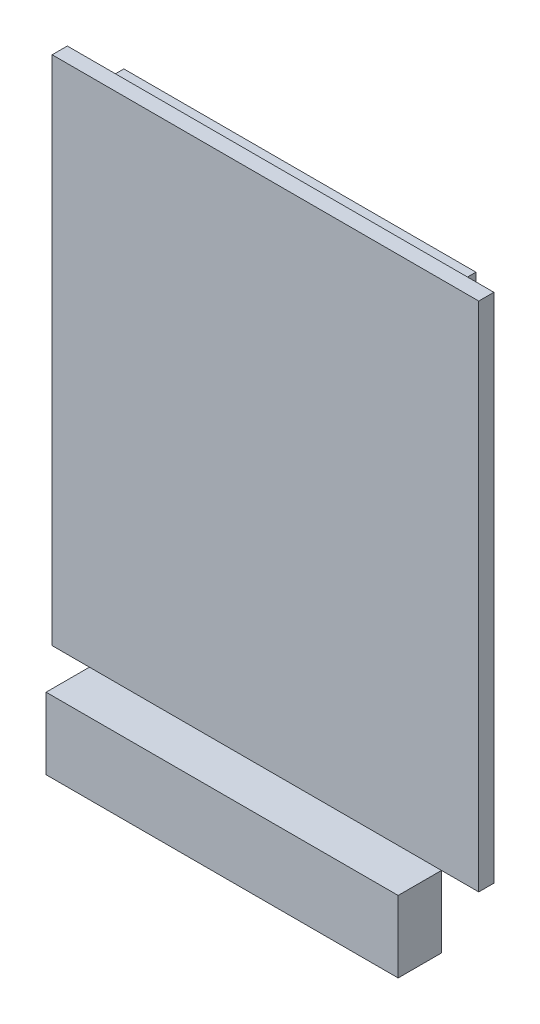
ISO-10303-21;
HEADER;
FILE_DESCRIPTION(('STEP AP214'),'2;1');
FILE_NAME('part.step','',(''),(''),'','','');
FILE_SCHEMA(('AUTOMOTIVE_DESIGN { 1 0 10303 214 1 1 1 1 }'));
ENDSEC;
DATA;
#1=APPLICATION_CONTEXT('core data for automotive mechanical design processes');
#2=APPLICATION_PROTOCOL_DEFINITION('international standard','automotive_design',2000,#1);
#3=PRODUCT_CONTEXT('',#1,'mechanical');
#4=PRODUCT('Part','Part','',(#3));
#5=PRODUCT_RELATED_PRODUCT_CATEGORY('part','',(#4));
#6=PRODUCT_DEFINITION_FORMATION('','',#4);
#7=PRODUCT_DEFINITION_CONTEXT('part definition',#1,'design');
#8=PRODUCT_DEFINITION('design','',#6,#7);
#9=PRODUCT_DEFINITION_SHAPE('','',#8);
#10=(LENGTH_UNIT() NAMED_UNIT(*) SI_UNIT(.MILLI.,.METRE.));
#11=(NAMED_UNIT(*) PLANE_ANGLE_UNIT() SI_UNIT($,.RADIAN.));
#12=(NAMED_UNIT(*) SI_UNIT($,.STERADIAN.) SOLID_ANGLE_UNIT());
#13=UNCERTAINTY_MEASURE_WITH_UNIT(LENGTH_MEASURE(1.E-05),#10,'distance_accuracy_value','');
#14=(GEOMETRIC_REPRESENTATION_CONTEXT(3) GLOBAL_UNCERTAINTY_ASSIGNED_CONTEXT((#13)) GLOBAL_UNIT_ASSIGNED_CONTEXT((#10,
#11,#12)) REPRESENTATION_CONTEXT('',''));
#15=CARTESIAN_POINT('',(0.,0.,0.));
#16=DIRECTION('',(0.,0.,1.));
#17=DIRECTION('',(1.,0.,0.));
#18=AXIS2_PLACEMENT_3D('',#15,#16,#17);
#19=CARTESIAN_POINT('',(4.36880000000001,0.,6.858));
#20=DIRECTION('',(1.,0.,0.));
#21=DIRECTION('',(0.,1.,0.));
#22=AXIS2_PLACEMENT_3D('',#19,#20,#21);
#23=PLANE('',#22);
#24=DIRECTION('',(0.,-1.,0.));
#25=VECTOR('',#24,1.);
#26=CARTESIAN_POINT('',(4.36880000000001,0.,1.778));
#27=LINE('',#26,#25);
#28=CARTESIAN_POINT('',(4.36880000000001,0.,1.778));
#29=VERTEX_POINT('',#28);
#30=CARTESIAN_POINT('',(4.3688,-8.38199999999999,1.778));
#31=VERTEX_POINT('',#30);
#32=EDGE_CURVE('E106',#29,#31,#27,.T.);
#33=ORIENTED_EDGE('',*,*,#32,.T.);
#34=DIRECTION('',(0.,0.,-1.));
#35=VECTOR('',#34,1.);
#36=CARTESIAN_POINT('',(4.3688,-8.38199999999999,6.858));
#37=LINE('',#36,#35);
#38=CARTESIAN_POINT('',(4.3688,-8.38199999999999,6.858));
#39=VERTEX_POINT('',#38);
#40=EDGE_CURVE('E12',#39,#31,#37,.T.);
#41=ORIENTED_EDGE('',*,*,#40,.F.);
#42=DIRECTION('',(0.,-1.,0.));
#43=VECTOR('',#42,1.);
#44=CARTESIAN_POINT('',(4.36880000000001,0.,6.858));
#45=LINE('',#44,#43);
#46=CARTESIAN_POINT('',(4.36880000000001,0.,6.858));
#47=VERTEX_POINT('',#46);
#48=EDGE_CURVE('E94',#47,#39,#45,.T.);
#49=ORIENTED_EDGE('',*,*,#48,.F.);
#50=DIRECTION('',(0.,0.,-1.));
#51=VECTOR('',#50,1.);
#52=CARTESIAN_POINT('',(4.36880000000001,0.,6.858));
#53=LINE('',#52,#51);
#54=EDGE_CURVE('E102',#47,#29,#53,.T.);
#55=ORIENTED_EDGE('',*,*,#54,.T.);
#56=EDGE_LOOP('',(#33,#41,#49,#55));
#57=FACE_BOUND('',#56,.T.);
#58=ADVANCED_FACE('F43',(#57),#23,.F.);
#59=CARTESIAN_POINT('',(4.3688,-8.38199999999999,6.858));
#60=DIRECTION('',(0.,1.,0.));
#61=DIRECTION('',(-1.,0.,0.));
#62=AXIS2_PLACEMENT_3D('',#59,#60,#61);
#63=PLANE('',#62);
#64=DIRECTION('',(1.,0.,0.));
#65=VECTOR('',#64,1.);
#66=CARTESIAN_POINT('',(4.3688,-8.38199999999999,1.778));
#67=LINE('',#66,#65);
#68=CARTESIAN_POINT('',(45.6438,-8.382,1.778));
#69=VERTEX_POINT('',#68);
#70=EDGE_CURVE('E98',#31,#69,#67,.T.);
#71=ORIENTED_EDGE('',*,*,#70,.T.);
#72=DIRECTION('',(0.,0.,-1.));
#73=VECTOR('',#72,1.);
#74=CARTESIAN_POINT('',(45.6438,-8.382,6.858));
#75=LINE('',#74,#73);
#76=CARTESIAN_POINT('',(45.6438,-8.382,6.858));
#77=VERTEX_POINT('',#76);
#78=EDGE_CURVE('E51',#77,#69,#75,.T.);
#79=ORIENTED_EDGE('',*,*,#78,.F.);
#80=DIRECTION('',(1.,0.,0.));
#81=VECTOR('',#80,1.);
#82=CARTESIAN_POINT('',(4.3688,-8.38199999999999,6.858));
#83=LINE('',#82,#81);
#84=EDGE_CURVE('E89',#39,#77,#83,.T.);
#85=ORIENTED_EDGE('',*,*,#84,.F.);
#86=ORIENTED_EDGE('',*,*,#40,.T.);
#87=EDGE_LOOP('',(#71,#79,#85,#86));
#88=FACE_BOUND('',#87,.T.);
#89=ADVANCED_FACE('F97',(#88),#63,.F.);
#90=CARTESIAN_POINT('',(45.6438,0.,6.858));
#91=DIRECTION('',(-1.,0.,0.));
#92=DIRECTION('',(0.,-1.,0.));
#93=AXIS2_PLACEMENT_3D('',#90,#91,#92);
#94=PLANE('',#93);
#95=DIRECTION('',(0.,1.,0.));
#96=VECTOR('',#95,1.);
#97=CARTESIAN_POINT('',(45.6438,0.,1.778));
#98=LINE('',#97,#96);
#99=CARTESIAN_POINT('',(45.6438,0.,1.778));
#100=VERTEX_POINT('',#99);
#101=EDGE_CURVE('E76',#69,#100,#98,.T.);
#102=ORIENTED_EDGE('',*,*,#101,.T.);
#103=DIRECTION('',(0.,0.,-1.));
#104=VECTOR('',#103,1.);
#105=CARTESIAN_POINT('',(45.6438,0.,6.858));
#106=LINE('',#105,#104);
#107=CARTESIAN_POINT('',(45.6438,0.,6.858));
#108=VERTEX_POINT('',#107);
#109=EDGE_CURVE('E99',#108,#100,#106,.T.);
#110=ORIENTED_EDGE('',*,*,#109,.F.);
#111=DIRECTION('',(0.,1.,0.));
#112=VECTOR('',#111,1.);
#113=CARTESIAN_POINT('',(45.6438,0.,6.858));
#114=LINE('',#113,#112);
#115=EDGE_CURVE('E92',#77,#108,#114,.T.);
#116=ORIENTED_EDGE('',*,*,#115,.F.);
#117=ORIENTED_EDGE('',*,*,#78,.T.);
#118=EDGE_LOOP('',(#102,#110,#116,#117));
#119=FACE_BOUND('',#118,.T.);
#120=ADVANCED_FACE('F100',(#119),#94,.F.);
#121=CARTESIAN_POINT('',(4.36880000000001,0.,6.858));
#122=DIRECTION('',(0.,-1.,0.));
#123=DIRECTION('',(1.,0.,0.));
#124=AXIS2_PLACEMENT_3D('',#121,#122,#123);
#125=PLANE('',#124);
#126=DIRECTION('',(-1.,0.,0.));
#127=VECTOR('',#126,1.);
#128=CARTESIAN_POINT('',(4.36880000000001,0.,1.778));
#129=LINE('',#128,#127);
#130=EDGE_CURVE('E82',#100,#29,#129,.T.);
#131=ORIENTED_EDGE('',*,*,#130,.T.);
#132=ORIENTED_EDGE('',*,*,#54,.F.);
#133=DIRECTION('',(-1.,0.,0.));
#134=VECTOR('',#133,1.);
#135=CARTESIAN_POINT('',(4.36880000000001,0.,6.858));
#136=LINE('',#135,#134);
#137=EDGE_CURVE('E59',#108,#47,#136,.T.);
#138=ORIENTED_EDGE('',*,*,#137,.F.);
#139=ORIENTED_EDGE('',*,*,#109,.T.);
#140=EDGE_LOOP('',(#131,#132,#138,#139));
#141=FACE_BOUND('',#140,.T.);
#142=ADVANCED_FACE('F113',(#141),#125,.F.);
#143=CARTESIAN_POINT('',(0.,0.,6.858));
#144=DIRECTION('',(0.,0.,1.));
#145=DIRECTION('',(1.,0.,0.));
#146=AXIS2_PLACEMENT_3D('',#143,#144,#145);
#147=PLANE('',#146);
#148=ORIENTED_EDGE('',*,*,#48,.T.);
#149=ORIENTED_EDGE('',*,*,#84,.T.);
#150=ORIENTED_EDGE('',*,*,#115,.T.);
#151=ORIENTED_EDGE('',*,*,#137,.T.);
#152=EDGE_LOOP('',(#148,#149,#150,#151));
#153=FACE_BOUND('',#152,.T.);
#154=ADVANCED_FACE('F90',(#153),#147,.T.);
#155=CARTESIAN_POINT('',(0.,0.,1.778));
#156=DIRECTION('',(0.,0.,1.));
#157=DIRECTION('',(1.,0.,0.));
#158=AXIS2_PLACEMENT_3D('',#155,#156,#157);
#159=PLANE('',#158);
#160=ORIENTED_EDGE('',*,*,#32,.F.);
#161=ORIENTED_EDGE('',*,*,#130,.F.);
#162=ORIENTED_EDGE('',*,*,#101,.F.);
#163=ORIENTED_EDGE('',*,*,#70,.F.);
#164=EDGE_LOOP('',(#160,#161,#162,#163));
#165=FACE_BOUND('',#164,.T.);
#166=ADVANCED_FACE('F116',(#165),#159,.F.);
#167=CLOSED_SHELL('',(#58,#89,#120,#142,#154,#166));
#168=MANIFOLD_SOLID_BREP('B2',#167);
#169=CARTESIAN_POINT('',(0.,0.,0.));
#170=DIRECTION('',(0.,0.,1.));
#171=DIRECTION('',(1.,0.,0.));
#172=AXIS2_PLACEMENT_3D('',#169,#170,#171);
#173=PLANE('',#172);
#174=DIRECTION('',(0.,-1.,0.));
#175=VECTOR('',#174,1.);
#176=CARTESIAN_POINT('',(0.,59.9948,0.));
#177=LINE('',#176,#175);
#178=CARTESIAN_POINT('',(0.,59.9948,0.));
#179=VERTEX_POINT('',#178);
#180=CARTESIAN_POINT('',(0.,0.,0.));
#181=VERTEX_POINT('',#180);
#182=EDGE_CURVE('E253',#179,#181,#177,.T.);
#183=ORIENTED_EDGE('',*,*,#182,.F.);
#184=DIRECTION('',(-1.,0.,0.));
#185=VECTOR('',#184,1.);
#186=CARTESIAN_POINT('',(0.,59.9948,0.));
#187=LINE('',#186,#185);
#188=CARTESIAN_POINT('',(50.0126,59.9948,0.));
#189=VERTEX_POINT('',#188);
#190=EDGE_CURVE('E266',#189,#179,#187,.T.);
#191=ORIENTED_EDGE('',*,*,#190,.F.);
#192=DIRECTION('',(0.,1.,0.));
#193=VECTOR('',#192,1.);
#194=CARTESIAN_POINT('',(50.0126,59.9948,0.));
#195=LINE('',#194,#193);
#196=CARTESIAN_POINT('',(50.0126,0.,0.));
#197=VERTEX_POINT('',#196);
#198=EDGE_CURVE('E274',#197,#189,#195,.T.);
#199=ORIENTED_EDGE('',*,*,#198,.F.);
#200=DIRECTION('',(1.,0.,0.));
#201=VECTOR('',#200,1.);
#202=CARTESIAN_POINT('',(0.,0.,0.));
#203=LINE('',#202,#201);
#204=EDGE_CURVE('E256',#181,#197,#203,.T.);
#205=ORIENTED_EDGE('',*,*,#204,.F.);
#206=EDGE_LOOP('',(#183,#191,#199,#205));
#207=FACE_BOUND('',#206,.T.);
#208=DIRECTION('',(0.,-1.,0.));
#209=VECTOR('',#208,1.);
#210=CARTESIAN_POINT('',(45.6438,58.7248,0.));
#211=LINE('',#210,#209);
#212=CARTESIAN_POINT('',(45.6438,58.7248,0.));
#213=VERTEX_POINT('',#212);
#214=CARTESIAN_POINT('',(45.6438,53.6448,0.));
#215=VERTEX_POINT('',#214);
#216=EDGE_CURVE('E252',#213,#215,#211,.T.);
#217=ORIENTED_EDGE('',*,*,#216,.F.);
#218=DIRECTION('',(1.,0.,0.));
#219=VECTOR('',#218,1.);
#220=CARTESIAN_POINT('',(45.6438,58.7248,0.));
#221=LINE('',#220,#219);
#222=CARTESIAN_POINT('',(4.36880000000001,58.7248,0.));
#223=VERTEX_POINT('',#222);
#224=EDGE_CURVE('E249',#223,#213,#221,.T.);
#225=ORIENTED_EDGE('',*,*,#224,.F.);
#226=DIRECTION('',(0.,1.,0.));
#227=VECTOR('',#226,1.);
#228=CARTESIAN_POINT('',(4.36880000000001,58.7248,0.));
#229=LINE('',#228,#227);
#230=CARTESIAN_POINT('',(4.36880000000001,53.6448,0.));
#231=VERTEX_POINT('',#230);
#232=EDGE_CURVE('E187',#231,#223,#229,.T.);
#233=ORIENTED_EDGE('',*,*,#232,.F.);
#234=DIRECTION('',(-1.,0.,0.));
#235=VECTOR('',#234,1.);
#236=CARTESIAN_POINT('',(45.6438,53.6448,0.));
#237=LINE('',#236,#235);
#238=EDGE_CURVE('E182',#215,#231,#237,.T.);
#239=ORIENTED_EDGE('',*,*,#238,.F.);
#240=EDGE_LOOP('',(#217,#225,#233,#239));
#241=FACE_BOUND('',#240,.T.);
#242=ADVANCED_FACE('F167',(#207,#241),#173,.F.);
#243=CARTESIAN_POINT('',(0.,59.9948,1.778));
#244=DIRECTION('',(1.,0.,0.));
#245=DIRECTION('',(0.,1.,0.));
#246=AXIS2_PLACEMENT_3D('',#243,#244,#245);
#247=PLANE('',#246);
#248=ORIENTED_EDGE('',*,*,#182,.T.);
#249=DIRECTION('',(0.,0.,-1.));
#250=VECTOR('',#249,1.);
#251=CARTESIAN_POINT('',(0.,0.,1.778));
#252=LINE('',#251,#250);
#253=CARTESIAN_POINT('',(0.,0.,1.778));
#254=VERTEX_POINT('',#253);
#255=EDGE_CURVE('E41',#254,#181,#252,.T.);
#256=ORIENTED_EDGE('',*,*,#255,.F.);
#257=DIRECTION('',(0.,-1.,0.));
#258=VECTOR('',#257,1.);
#259=CARTESIAN_POINT('',(0.,59.9948,1.778));
#260=LINE('',#259,#258);
#261=CARTESIAN_POINT('',(0.,59.9948,1.778));
#262=VERTEX_POINT('',#261);
#263=EDGE_CURVE('E262',#262,#254,#260,.T.);
#264=ORIENTED_EDGE('',*,*,#263,.F.);
#265=DIRECTION('',(0.,0.,-1.));
#266=VECTOR('',#265,1.);
#267=CARTESIAN_POINT('',(0.,59.9948,1.778));
#268=LINE('',#267,#266);
#269=EDGE_CURVE('E271',#262,#179,#268,.T.);
#270=ORIENTED_EDGE('',*,*,#269,.T.);
#271=EDGE_LOOP('',(#248,#256,#264,#270));
#272=FACE_BOUND('',#271,.T.);
#273=ADVANCED_FACE('F169',(#272),#247,.F.);
#274=CARTESIAN_POINT('',(0.,0.,1.778));
#275=DIRECTION('',(0.,1.,0.));
#276=DIRECTION('',(-1.,0.,0.));
#277=AXIS2_PLACEMENT_3D('',#274,#275,#276);
#278=PLANE('',#277);
#279=ORIENTED_EDGE('',*,*,#204,.T.);
#280=DIRECTION('',(0.,0.,-1.));
#281=VECTOR('',#280,1.);
#282=CARTESIAN_POINT('',(50.0126,0.,1.778));
#283=LINE('',#282,#281);
#284=CARTESIAN_POINT('',(50.0126,0.,1.778));
#285=VERTEX_POINT('',#284);
#286=EDGE_CURVE('E175',#285,#197,#283,.T.);
#287=ORIENTED_EDGE('',*,*,#286,.F.);
#288=DIRECTION('',(1.,0.,0.));
#289=VECTOR('',#288,1.);
#290=CARTESIAN_POINT('',(0.,0.,1.778));
#291=LINE('',#290,#289);
#292=EDGE_CURVE('E265',#254,#285,#291,.T.);
#293=ORIENTED_EDGE('',*,*,#292,.F.);
#294=ORIENTED_EDGE('',*,*,#255,.T.);
#295=EDGE_LOOP('',(#279,#287,#293,#294));
#296=FACE_BOUND('',#295,.T.);
#297=ADVANCED_FACE('F301',(#296),#278,.F.);
#298=CARTESIAN_POINT('',(50.0126,59.9948,1.778));
#299=DIRECTION('',(-1.,0.,0.));
#300=DIRECTION('',(0.,0.,1.));
#301=AXIS2_PLACEMENT_3D('',#298,#299,#300);
#302=PLANE('',#301);
#303=ORIENTED_EDGE('',*,*,#198,.T.);
#304=DIRECTION('',(0.,0.,-1.));
#305=VECTOR('',#304,1.);
#306=CARTESIAN_POINT('',(50.0126,59.9948,1.778));
#307=LINE('',#306,#305);
#308=CARTESIAN_POINT('',(50.0126,59.9948,1.778));
#309=VERTEX_POINT('',#308);
#310=EDGE_CURVE('E279',#309,#189,#307,.T.);
#311=ORIENTED_EDGE('',*,*,#310,.F.);
#312=DIRECTION('',(0.,1.,0.));
#313=VECTOR('',#312,1.);
#314=CARTESIAN_POINT('',(50.0126,59.9948,1.778));
#315=LINE('',#314,#313);
#316=EDGE_CURVE('E268',#285,#309,#315,.T.);
#317=ORIENTED_EDGE('',*,*,#316,.F.);
#318=ORIENTED_EDGE('',*,*,#286,.T.);
#319=EDGE_LOOP('',(#303,#311,#317,#318));
#320=FACE_BOUND('',#319,.T.);
#321=ADVANCED_FACE('F286',(#320),#302,.F.);
#322=CARTESIAN_POINT('',(0.,59.9948,1.778));
#323=DIRECTION('',(0.,-1.,0.));
#324=DIRECTION('',(0.,0.,-1.));
#325=AXIS2_PLACEMENT_3D('',#322,#323,#324);
#326=PLANE('',#325);
#327=ORIENTED_EDGE('',*,*,#190,.T.);
#328=ORIENTED_EDGE('',*,*,#269,.F.);
#329=DIRECTION('',(-1.,0.,0.));
#330=VECTOR('',#329,1.);
#331=CARTESIAN_POINT('',(0.,59.9948,1.778));
#332=LINE('',#331,#330);
#333=EDGE_CURVE('E270',#309,#262,#332,.T.);
#334=ORIENTED_EDGE('',*,*,#333,.F.);
#335=ORIENTED_EDGE('',*,*,#310,.T.);
#336=EDGE_LOOP('',(#327,#328,#334,#335));
#337=FACE_BOUND('',#336,.T.);
#338=ADVANCED_FACE('F294',(#337),#326,.F.);
#339=CARTESIAN_POINT('',(0.,0.,1.778));
#340=DIRECTION('',(0.,0.,1.));
#341=DIRECTION('',(1.,0.,0.));
#342=AXIS2_PLACEMENT_3D('',#339,#340,#341);
#343=PLANE('',#342);
#344=ORIENTED_EDGE('',*,*,#263,.T.);
#345=ORIENTED_EDGE('',*,*,#292,.T.);
#346=ORIENTED_EDGE('',*,*,#316,.T.);
#347=ORIENTED_EDGE('',*,*,#333,.T.);
#348=EDGE_LOOP('',(#344,#345,#346,#347));
#349=FACE_BOUND('',#348,.T.);
#350=ADVANCED_FACE('F300',(#349),#343,.T.);
#351=CARTESIAN_POINT('',(45.6438,58.7248,-2.2606));
#352=DIRECTION('',(-1.,0.,0.));
#353=DIRECTION('',(0.,0.,1.));
#354=AXIS2_PLACEMENT_3D('',#351,#352,#353);
#355=PLANE('',#354);
#356=ORIENTED_EDGE('',*,*,#216,.T.);
#357=DIRECTION('',(0.,0.,1.));
#358=VECTOR('',#357,1.);
#359=CARTESIAN_POINT('',(45.6438,53.6448,-2.2606));
#360=LINE('',#359,#358);
#361=CARTESIAN_POINT('',(45.6438,53.6448,-2.2606));
#362=VERTEX_POINT('',#361);
#363=EDGE_CURVE('E233',#362,#215,#360,.T.);
#364=ORIENTED_EDGE('',*,*,#363,.F.);
#365=DIRECTION('',(0.,-1.,0.));
#366=VECTOR('',#365,1.);
#367=CARTESIAN_POINT('',(45.6438,58.7248,-2.2606));
#368=LINE('',#367,#366);
#369=CARTESIAN_POINT('',(45.6438,58.7248,-2.2606));
#370=VERTEX_POINT('',#369);
#371=EDGE_CURVE('E240',#370,#362,#368,.T.);
#372=ORIENTED_EDGE('',*,*,#371,.F.);
#373=DIRECTION('',(0.,0.,1.));
#374=VECTOR('',#373,1.);
#375=CARTESIAN_POINT('',(45.6438,58.7248,-2.2606));
#376=LINE('',#375,#374);
#377=EDGE_CURVE('E394',#370,#213,#376,.T.);
#378=ORIENTED_EDGE('',*,*,#377,.T.);
#379=EDGE_LOOP('',(#356,#364,#372,#378));
#380=FACE_BOUND('',#379,.T.);
#381=ADVANCED_FACE('F251',(#380),#355,.F.);
#382=CARTESIAN_POINT('',(45.6438,53.6448,-2.2606));
#383=DIRECTION('',(0.,1.,0.));
#384=DIRECTION('',(-1.,0.,0.));
#385=AXIS2_PLACEMENT_3D('',#382,#383,#384);
#386=PLANE('',#385);
#387=ORIENTED_EDGE('',*,*,#238,.T.);
#388=DIRECTION('',(0.,0.,1.));
#389=VECTOR('',#388,1.);
#390=CARTESIAN_POINT('',(4.36880000000001,53.6448,-2.2606));
#391=LINE('',#390,#389);
#392=CARTESIAN_POINT('',(4.36880000000001,53.6448,-2.2606));
#393=VERTEX_POINT('',#392);
#394=EDGE_CURVE('E236',#393,#231,#391,.T.);
#395=ORIENTED_EDGE('',*,*,#394,.F.);
#396=DIRECTION('',(-1.,0.,0.));
#397=VECTOR('',#396,1.);
#398=CARTESIAN_POINT('',(45.6438,53.6448,-2.2606));
#399=LINE('',#398,#397);
#400=EDGE_CURVE('E229',#362,#393,#399,.T.);
#401=ORIENTED_EDGE('',*,*,#400,.F.);
#402=ORIENTED_EDGE('',*,*,#363,.T.);
#403=EDGE_LOOP('',(#387,#395,#401,#402));
#404=FACE_BOUND('',#403,.T.);
#405=ADVANCED_FACE('F231',(#404),#386,.F.);
#406=CARTESIAN_POINT('',(4.36880000000001,58.7248,-2.2606));
#407=DIRECTION('',(1.,0.,0.));
#408=DIRECTION('',(0.,1.,0.));
#409=AXIS2_PLACEMENT_3D('',#406,#407,#408);
#410=PLANE('',#409);
#411=ORIENTED_EDGE('',*,*,#232,.T.);
#412=DIRECTION('',(0.,0.,1.));
#413=VECTOR('',#412,1.);
#414=CARTESIAN_POINT('',(4.36880000000001,58.7248,-2.2606));
#415=LINE('',#414,#413);
#416=CARTESIAN_POINT('',(4.36880000000001,58.7248,-2.2606));
#417=VERTEX_POINT('',#416);
#418=EDGE_CURVE('E258',#417,#223,#415,.T.);
#419=ORIENTED_EDGE('',*,*,#418,.F.);
#420=DIRECTION('',(0.,1.,0.));
#421=VECTOR('',#420,1.);
#422=CARTESIAN_POINT('',(4.36880000000001,58.7248,-2.2606));
#423=LINE('',#422,#421);
#424=EDGE_CURVE('E239',#393,#417,#423,.T.);
#425=ORIENTED_EDGE('',*,*,#424,.F.);
#426=ORIENTED_EDGE('',*,*,#394,.T.);
#427=EDGE_LOOP('',(#411,#419,#425,#426));
#428=FACE_BOUND('',#427,.T.);
#429=ADVANCED_FACE('F326',(#428),#410,.F.);
#430=CARTESIAN_POINT('',(45.6438,58.7248,-2.2606));
#431=DIRECTION('',(0.,-1.,0.));
#432=DIRECTION('',(0.,0.,-1.));
#433=AXIS2_PLACEMENT_3D('',#430,#431,#432);
#434=PLANE('',#433);
#435=ORIENTED_EDGE('',*,*,#224,.T.);
#436=ORIENTED_EDGE('',*,*,#377,.F.);
#437=DIRECTION('',(1.,0.,0.));
#438=VECTOR('',#437,1.);
#439=CARTESIAN_POINT('',(45.6438,58.7248,-2.2606));
#440=LINE('',#439,#438);
#441=EDGE_CURVE('E245',#417,#370,#440,.T.);
#442=ORIENTED_EDGE('',*,*,#441,.F.);
#443=ORIENTED_EDGE('',*,*,#418,.T.);
#444=EDGE_LOOP('',(#435,#436,#442,#443));
#445=FACE_BOUND('',#444,.T.);
#446=ADVANCED_FACE('F331',(#445),#434,.F.);
#447=CARTESIAN_POINT('',(0.,0.,-2.2606));
#448=DIRECTION('',(0.,0.,-1.));
#449=DIRECTION('',(-1.,0.,0.));
#450=AXIS2_PLACEMENT_3D('',#447,#448,#449);
#451=PLANE('',#450);
#452=ORIENTED_EDGE('',*,*,#371,.T.);
#453=ORIENTED_EDGE('',*,*,#400,.T.);
#454=ORIENTED_EDGE('',*,*,#424,.T.);
#455=ORIENTED_EDGE('',*,*,#441,.T.);
#456=EDGE_LOOP('',(#452,#453,#454,#455));
#457=FACE_BOUND('',#456,.T.);
#458=ADVANCED_FACE('F243',(#457),#451,.T.);
#459=CLOSED_SHELL('',(#242,#273,#297,#321,#338,#350,#381,#405,#429,#446,#458));
#460=MANIFOLD_SOLID_BREP('B6',#459);
#461=ADVANCED_BREP_SHAPE_REPRESENTATION('',(#18,#168,#460),#14);
#462=SHAPE_DEFINITION_REPRESENTATION(#9,#461);
ENDSEC;
END-ISO-10303-21;
